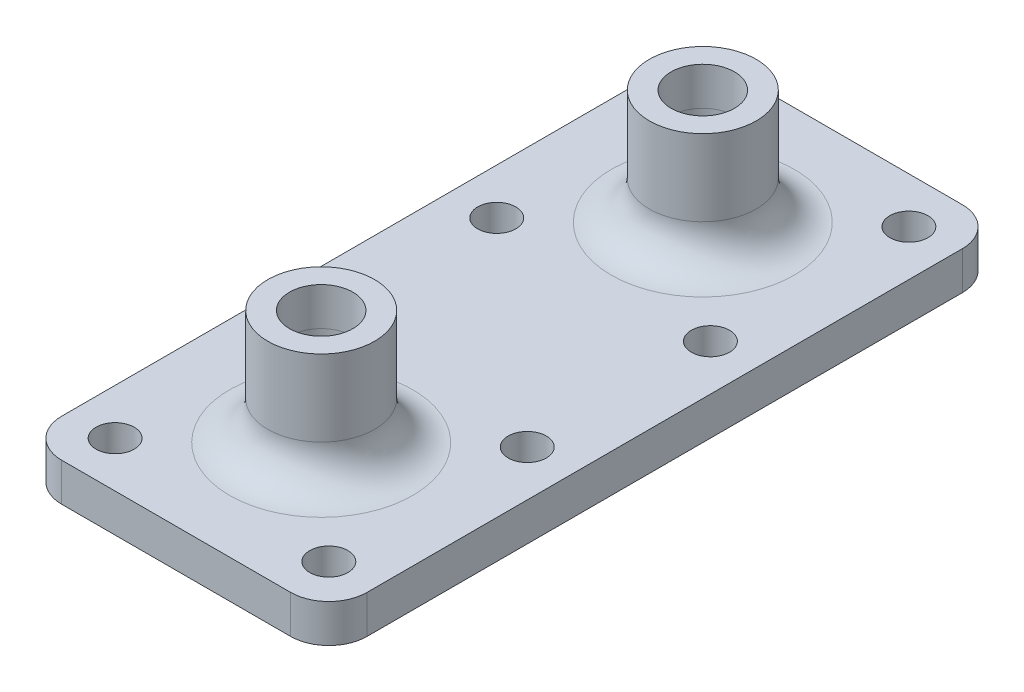
ISO-10303-21;
HEADER;
FILE_DESCRIPTION(('STEP AP214'),'2;1');
FILE_NAME('part.step','',(''),(''),'','','');
FILE_SCHEMA(('AUTOMOTIVE_DESIGN { 1 0 10303 214 1 1 1 1 }'));
ENDSEC;
DATA;
#1=APPLICATION_CONTEXT('core data for automotive mechanical design processes');
#2=APPLICATION_PROTOCOL_DEFINITION('international standard','automotive_design',2000,#1);
#3=PRODUCT_CONTEXT('',#1,'mechanical');
#4=PRODUCT('Part','Part','',(#3));
#5=PRODUCT_RELATED_PRODUCT_CATEGORY('part','',(#4));
#6=PRODUCT_DEFINITION_FORMATION('','',#4);
#7=PRODUCT_DEFINITION_CONTEXT('part definition',#1,'design');
#8=PRODUCT_DEFINITION('design','',#6,#7);
#9=PRODUCT_DEFINITION_SHAPE('','',#8);
#10=(LENGTH_UNIT() NAMED_UNIT(*) SI_UNIT(.MILLI.,.METRE.));
#11=(NAMED_UNIT(*) PLANE_ANGLE_UNIT() SI_UNIT($,.RADIAN.));
#12=(NAMED_UNIT(*) SI_UNIT($,.STERADIAN.) SOLID_ANGLE_UNIT());
#13=UNCERTAINTY_MEASURE_WITH_UNIT(LENGTH_MEASURE(1.E-05),#10,'distance_accuracy_value','');
#14=(GEOMETRIC_REPRESENTATION_CONTEXT(3) GLOBAL_UNCERTAINTY_ASSIGNED_CONTEXT((#13)) GLOBAL_UNIT_ASSIGNED_CONTEXT((#10,
#11,#12)) REPRESENTATION_CONTEXT('',''));
#15=CARTESIAN_POINT('',(0.,0.,0.));
#16=DIRECTION('',(0.,0.,1.));
#17=DIRECTION('',(1.,0.,0.));
#18=AXIS2_PLACEMENT_3D('',#15,#16,#17);
#19=CARTESIAN_POINT('',(0.,5.,0.));
#20=DIRECTION('',(0.,1.,0.));
#21=DIRECTION('',(0.,0.,1.));
#22=AXIS2_PLACEMENT_3D('',#19,#20,#21);
#23=PLANE('',#22);
#24=CARTESIAN_POINT('',(0.,5.,25.));
#25=DIRECTION('',(0.,1.,0.));
#26=DIRECTION('',(0.,0.,1.));
#27=AXIS2_PLACEMENT_3D('',#24,#25,#26);
#28=CIRCLE('',#27,12.);
#29=CARTESIAN_POINT('',(0.,5.,37.));
#30=VERTEX_POINT('',#29);
#31=EDGE_CURVE('E167',#30,#30,#28,.F.);
#32=ORIENTED_EDGE('',*,*,#31,.T.);
#33=EDGE_LOOP('',(#32));
#34=FACE_BOUND('',#33,.T.);
#35=CARTESIAN_POINT('',(0.,5.,-25.));
#36=DIRECTION('',(0.,1.,0.));
#37=DIRECTION('',(0.,0.,1.));
#38=AXIS2_PLACEMENT_3D('',#35,#36,#37);
#39=CIRCLE('',#38,12.);
#40=CARTESIAN_POINT('',(0.,5.,-13.));
#41=VERTEX_POINT('',#40);
#42=EDGE_CURVE('E164',#41,#41,#39,.F.);
#43=ORIENTED_EDGE('',*,*,#42,.T.);
#44=EDGE_LOOP('',(#43));
#45=FACE_BOUND('',#44,.T.);
#46=CARTESIAN_POINT('',(14.,5.,37.9999999999999));
#47=DIRECTION('',(0.,1.,0.));
#48=DIRECTION('',(0.,0.,1.));
#49=AXIS2_PLACEMENT_3D('',#46,#47,#48);
#50=CIRCLE('',#49,2.5);
#51=CARTESIAN_POINT('',(14.,5.,40.4999999999999));
#52=VERTEX_POINT('',#51);
#53=EDGE_CURVE('E207',#52,#52,#50,.T.);
#54=ORIENTED_EDGE('',*,*,#53,.F.);
#55=EDGE_LOOP('',(#54));
#56=FACE_BOUND('',#55,.T.);
#57=CARTESIAN_POINT('',(-14.,5.,11.9999999999999));
#58=DIRECTION('',(0.,1.,0.));
#59=DIRECTION('',(0.,0.,1.));
#60=AXIS2_PLACEMENT_3D('',#57,#58,#59);
#61=CIRCLE('',#60,2.5);
#62=CARTESIAN_POINT('',(-14.,5.,14.4999999999999));
#63=VERTEX_POINT('',#62);
#64=EDGE_CURVE('E211',#63,#63,#61,.T.);
#65=ORIENTED_EDGE('',*,*,#64,.F.);
#66=EDGE_LOOP('',(#65));
#67=FACE_BOUND('',#66,.T.);
#68=CARTESIAN_POINT('',(14.,5.,-12.0000000000001));
#69=DIRECTION('',(0.,1.,0.));
#70=DIRECTION('',(0.,0.,1.));
#71=AXIS2_PLACEMENT_3D('',#68,#69,#70);
#72=CIRCLE('',#71,2.5);
#73=CARTESIAN_POINT('',(14.,5.,-9.50000000000014));
#74=VERTEX_POINT('',#73);
#75=EDGE_CURVE('E215',#74,#74,#72,.T.);
#76=ORIENTED_EDGE('',*,*,#75,.F.);
#77=EDGE_LOOP('',(#76));
#78=FACE_BOUND('',#77,.T.);
#79=CARTESIAN_POINT('',(14.,5.,-38.0000000000001));
#80=DIRECTION('',(0.,1.,0.));
#81=DIRECTION('',(0.,0.,1.));
#82=AXIS2_PLACEMENT_3D('',#79,#80,#81);
#83=CIRCLE('',#82,2.5);
#84=CARTESIAN_POINT('',(14.,5.,-35.5000000000001));
#85=VERTEX_POINT('',#84);
#86=EDGE_CURVE('E218',#85,#85,#83,.T.);
#87=ORIENTED_EDGE('',*,*,#86,.F.);
#88=EDGE_LOOP('',(#87));
#89=FACE_BOUND('',#88,.T.);
#90=DIRECTION('',(0.,0.,-1.));
#91=VECTOR('',#90,1.);
#92=CARTESIAN_POINT('',(20.,5.,44.0000000000001));
#93=LINE('',#92,#91);
#94=CARTESIAN_POINT('',(20.,5.,39.0000000000001));
#95=VERTEX_POINT('',#94);
#96=CARTESIAN_POINT('',(20.,5.,-39.0000000000001));
#97=VERTEX_POINT('',#96);
#98=EDGE_CURVE('E222',#95,#97,#93,.T.);
#99=ORIENTED_EDGE('',*,*,#98,.T.);
#100=CARTESIAN_POINT('',(15.,5.,-39.0000000000001));
#101=DIRECTION('',(0.,1.,0.));
#102=DIRECTION('',(0.,0.,1.));
#103=AXIS2_PLACEMENT_3D('',#100,#101,#102);
#104=CIRCLE('',#103,5.);
#105=CARTESIAN_POINT('',(15.,5.,-44.0000000000001));
#106=VERTEX_POINT('',#105);
#107=EDGE_CURVE('E175',#97,#106,#104,.T.);
#108=ORIENTED_EDGE('',*,*,#107,.T.);
#109=DIRECTION('',(-1.,0.,0.));
#110=VECTOR('',#109,1.);
#111=CARTESIAN_POINT('',(20.,5.,-44.0000000000001));
#112=LINE('',#111,#110);
#113=CARTESIAN_POINT('',(-15.,5.,-44.0000000000001));
#114=VERTEX_POINT('',#113);
#115=EDGE_CURVE('E128',#106,#114,#112,.T.);
#116=ORIENTED_EDGE('',*,*,#115,.T.);
#117=CARTESIAN_POINT('',(-15.,5.,-39.0000000000001));
#118=DIRECTION('',(0.,1.,0.));
#119=DIRECTION('',(0.,0.,1.));
#120=AXIS2_PLACEMENT_3D('',#117,#118,#119);
#121=CIRCLE('',#120,5.);
#122=CARTESIAN_POINT('',(-20.,5.,-39.0000000000001));
#123=VERTEX_POINT('',#122);
#124=EDGE_CURVE('E173',#114,#123,#121,.T.);
#125=ORIENTED_EDGE('',*,*,#124,.T.);
#126=DIRECTION('',(0.,0.,1.));
#127=VECTOR('',#126,1.);
#128=CARTESIAN_POINT('',(-20.,5.,44.0000000000001));
#129=LINE('',#128,#127);
#130=CARTESIAN_POINT('',(-20.,5.,39.0000000000001));
#131=VERTEX_POINT('',#130);
#132=EDGE_CURVE('E135',#123,#131,#129,.T.);
#133=ORIENTED_EDGE('',*,*,#132,.T.);
#134=CARTESIAN_POINT('',(-15.,5.,39.0000000000001));
#135=DIRECTION('',(0.,1.,0.));
#136=DIRECTION('',(0.,0.,1.));
#137=AXIS2_PLACEMENT_3D('',#134,#135,#136);
#138=CIRCLE('',#137,5.);
#139=CARTESIAN_POINT('',(-15.,5.,44.0000000000001));
#140=VERTEX_POINT('',#139);
#141=EDGE_CURVE('E63',#131,#140,#138,.T.);
#142=ORIENTED_EDGE('',*,*,#141,.T.);
#143=DIRECTION('',(1.,0.,0.));
#144=VECTOR('',#143,1.);
#145=CARTESIAN_POINT('',(20.,5.,44.0000000000001));
#146=LINE('',#145,#144);
#147=CARTESIAN_POINT('',(15.,5.,44.0000000000001));
#148=VERTEX_POINT('',#147);
#149=EDGE_CURVE('E138',#140,#148,#146,.T.);
#150=ORIENTED_EDGE('',*,*,#149,.T.);
#151=CARTESIAN_POINT('',(15.,5.,39.0000000000001));
#152=DIRECTION('',(0.,1.,0.));
#153=DIRECTION('',(0.,0.,1.));
#154=AXIS2_PLACEMENT_3D('',#151,#152,#153);
#155=CIRCLE('',#154,5.);
#156=EDGE_CURVE('E170',#148,#95,#155,.T.);
#157=ORIENTED_EDGE('',*,*,#156,.T.);
#158=EDGE_LOOP('',(#99,#108,#116,#125,#133,#142,#150,#157));
#159=FACE_BOUND('',#158,.T.);
#160=CARTESIAN_POINT('',(-14.,5.,-12.0000000000001));
#161=DIRECTION('',(0.,1.,0.));
#162=DIRECTION('',(0.,0.,1.));
#163=AXIS2_PLACEMENT_3D('',#160,#161,#162);
#164=CIRCLE('',#163,2.5);
#165=CARTESIAN_POINT('',(-14.,5.,-9.50000000000013));
#166=VERTEX_POINT('',#165);
#167=EDGE_CURVE('E226',#166,#166,#164,.T.);
#168=ORIENTED_EDGE('',*,*,#167,.F.);
#169=EDGE_LOOP('',(#168));
#170=FACE_BOUND('',#169,.T.);
#171=CARTESIAN_POINT('',(-14.,5.,-38.0000000000001));
#172=DIRECTION('',(0.,1.,0.));
#173=DIRECTION('',(0.,0.,1.));
#174=AXIS2_PLACEMENT_3D('',#171,#172,#173);
#175=CIRCLE('',#174,2.5);
#176=CARTESIAN_POINT('',(-14.,5.,-35.5000000000001));
#177=VERTEX_POINT('',#176);
#178=EDGE_CURVE('E230',#177,#177,#175,.T.);
#179=ORIENTED_EDGE('',*,*,#178,.F.);
#180=EDGE_LOOP('',(#179));
#181=FACE_BOUND('',#180,.T.);
#182=CARTESIAN_POINT('',(-14.,5.,37.9999999999999));
#183=DIRECTION('',(0.,1.,0.));
#184=DIRECTION('',(0.,0.,1.));
#185=AXIS2_PLACEMENT_3D('',#182,#183,#184);
#186=CIRCLE('',#185,2.5);
#187=CARTESIAN_POINT('',(-14.,5.,40.4999999999999));
#188=VERTEX_POINT('',#187);
#189=EDGE_CURVE('E234',#188,#188,#186,.T.);
#190=ORIENTED_EDGE('',*,*,#189,.F.);
#191=EDGE_LOOP('',(#190));
#192=FACE_BOUND('',#191,.T.);
#193=CARTESIAN_POINT('',(14.,5.,11.9999999999999));
#194=DIRECTION('',(0.,1.,0.));
#195=DIRECTION('',(0.,0.,1.));
#196=AXIS2_PLACEMENT_3D('',#193,#194,#195);
#197=CIRCLE('',#196,2.5);
#198=CARTESIAN_POINT('',(14.,5.,14.4999999999999));
#199=VERTEX_POINT('',#198);
#200=EDGE_CURVE('E237',#199,#199,#197,.T.);
#201=ORIENTED_EDGE('',*,*,#200,.F.);
#202=EDGE_LOOP('',(#201));
#203=FACE_BOUND('',#202,.T.);
#204=ADVANCED_FACE('F41',(#34,#45,#56,#67,#78,#89,#159,#170,#181,#192,#203),#23,.T.);
#205=CARTESIAN_POINT('',(0.,0.,0.));
#206=DIRECTION('',(0.,1.,0.));
#207=DIRECTION('',(0.,0.,1.));
#208=AXIS2_PLACEMENT_3D('',#205,#206,#207);
#209=PLANE('',#208);
#210=DIRECTION('',(-1.,0.,0.));
#211=VECTOR('',#210,1.);
#212=CARTESIAN_POINT('',(20.,0.,-44.0000000000001));
#213=LINE('',#212,#211);
#214=CARTESIAN_POINT('',(15.,0.,-44.0000000000001));
#215=VERTEX_POINT('',#214);
#216=CARTESIAN_POINT('',(-15.,0.,-44.0000000000001));
#217=VERTEX_POINT('',#216);
#218=EDGE_CURVE('E125',#215,#217,#213,.T.);
#219=ORIENTED_EDGE('',*,*,#218,.F.);
#220=CARTESIAN_POINT('',(15.,0.,-39.0000000000001));
#221=DIRECTION('',(0.,1.,0.));
#222=DIRECTION('',(0.,0.,1.));
#223=AXIS2_PLACEMENT_3D('',#220,#221,#222);
#224=CIRCLE('',#223,5.);
#225=CARTESIAN_POINT('',(20.,0.,-39.0000000000001));
#226=VERTEX_POINT('',#225);
#227=EDGE_CURVE('E108',#215,#226,#224,.F.);
#228=ORIENTED_EDGE('',*,*,#227,.T.);
#229=DIRECTION('',(0.,0.,-1.));
#230=VECTOR('',#229,1.);
#231=CARTESIAN_POINT('',(20.,0.,44.0000000000001));
#232=LINE('',#231,#230);
#233=CARTESIAN_POINT('',(20.,0.,39.0000000000001));
#234=VERTEX_POINT('',#233);
#235=EDGE_CURVE('E136',#234,#226,#232,.T.);
#236=ORIENTED_EDGE('',*,*,#235,.F.);
#237=CARTESIAN_POINT('',(15.,0.,39.0000000000001));
#238=DIRECTION('',(0.,1.,0.));
#239=DIRECTION('',(0.,0.,1.));
#240=AXIS2_PLACEMENT_3D('',#237,#238,#239);
#241=CIRCLE('',#240,5.);
#242=CARTESIAN_POINT('',(15.,0.,44.0000000000001));
#243=VERTEX_POINT('',#242);
#244=EDGE_CURVE('E129',#234,#243,#241,.F.);
#245=ORIENTED_EDGE('',*,*,#244,.T.);
#246=DIRECTION('',(1.,0.,0.));
#247=VECTOR('',#246,1.);
#248=CARTESIAN_POINT('',(20.,0.,44.0000000000001));
#249=LINE('',#248,#247);
#250=CARTESIAN_POINT('',(-15.,0.,44.0000000000001));
#251=VERTEX_POINT('',#250);
#252=EDGE_CURVE('E140',#251,#243,#249,.T.);
#253=ORIENTED_EDGE('',*,*,#252,.F.);
#254=CARTESIAN_POINT('',(-15.,0.,39.0000000000001));
#255=DIRECTION('',(0.,1.,0.));
#256=DIRECTION('',(0.,0.,1.));
#257=AXIS2_PLACEMENT_3D('',#254,#255,#256);
#258=CIRCLE('',#257,5.);
#259=CARTESIAN_POINT('',(-20.,0.,39.0000000000001));
#260=VERTEX_POINT('',#259);
#261=EDGE_CURVE('E158',#251,#260,#258,.F.);
#262=ORIENTED_EDGE('',*,*,#261,.T.);
#263=DIRECTION('',(0.,0.,1.));
#264=VECTOR('',#263,1.);
#265=CARTESIAN_POINT('',(-20.,0.,44.0000000000001));
#266=LINE('',#265,#264);
#267=CARTESIAN_POINT('',(-20.,0.,-39.0000000000001));
#268=VERTEX_POINT('',#267);
#269=EDGE_CURVE('E273',#268,#260,#266,.T.);
#270=ORIENTED_EDGE('',*,*,#269,.F.);
#271=CARTESIAN_POINT('',(-15.,0.,-39.0000000000001));
#272=DIRECTION('',(0.,1.,0.));
#273=DIRECTION('',(0.,0.,1.));
#274=AXIS2_PLACEMENT_3D('',#271,#272,#273);
#275=CIRCLE('',#274,5.);
#276=EDGE_CURVE('E119',#268,#217,#275,.F.);
#277=ORIENTED_EDGE('',*,*,#276,.T.);
#278=EDGE_LOOP('',(#219,#228,#236,#245,#253,#262,#270,#277));
#279=FACE_BOUND('',#278,.T.);
#280=CARTESIAN_POINT('',(14.,0.,-38.0000000000001));
#281=DIRECTION('',(0.,1.,0.));
#282=DIRECTION('',(0.,0.,1.));
#283=AXIS2_PLACEMENT_3D('',#280,#281,#282);
#284=CIRCLE('',#283,2.5);
#285=CARTESIAN_POINT('',(14.,0.,-35.5000000000001));
#286=VERTEX_POINT('',#285);
#287=EDGE_CURVE('E269',#286,#286,#284,.T.);
#288=ORIENTED_EDGE('',*,*,#287,.T.);
#289=EDGE_LOOP('',(#288));
#290=FACE_BOUND('',#289,.T.);
#291=CARTESIAN_POINT('',(-14.,0.,-12.0000000000001));
#292=DIRECTION('',(0.,1.,0.));
#293=DIRECTION('',(0.,0.,1.));
#294=AXIS2_PLACEMENT_3D('',#291,#292,#293);
#295=CIRCLE('',#294,2.5);
#296=CARTESIAN_POINT('',(-14.,0.,-9.50000000000013));
#297=VERTEX_POINT('',#296);
#298=EDGE_CURVE('E265',#297,#297,#295,.T.);
#299=ORIENTED_EDGE('',*,*,#298,.T.);
#300=EDGE_LOOP('',(#299));
#301=FACE_BOUND('',#300,.T.);
#302=CARTESIAN_POINT('',(14.,0.,-12.0000000000001));
#303=DIRECTION('',(0.,1.,0.));
#304=DIRECTION('',(0.,0.,1.));
#305=AXIS2_PLACEMENT_3D('',#302,#303,#304);
#306=CIRCLE('',#305,2.5);
#307=CARTESIAN_POINT('',(14.,0.,-9.50000000000014));
#308=VERTEX_POINT('',#307);
#309=EDGE_CURVE('E261',#308,#308,#306,.T.);
#310=ORIENTED_EDGE('',*,*,#309,.T.);
#311=EDGE_LOOP('',(#310));
#312=FACE_BOUND('',#311,.T.);
#313=CARTESIAN_POINT('',(-14.,0.,-38.0000000000001));
#314=DIRECTION('',(0.,1.,0.));
#315=DIRECTION('',(0.,0.,1.));
#316=AXIS2_PLACEMENT_3D('',#313,#314,#315);
#317=CIRCLE('',#316,2.5);
#318=CARTESIAN_POINT('',(-14.,0.,-35.5000000000001));
#319=VERTEX_POINT('',#318);
#320=EDGE_CURVE('E257',#319,#319,#317,.T.);
#321=ORIENTED_EDGE('',*,*,#320,.T.);
#322=EDGE_LOOP('',(#321));
#323=FACE_BOUND('',#322,.T.);
#324=CARTESIAN_POINT('',(-14.,0.,11.9999999999999));
#325=DIRECTION('',(0.,1.,0.));
#326=DIRECTION('',(0.,0.,1.));
#327=AXIS2_PLACEMENT_3D('',#324,#325,#326);
#328=CIRCLE('',#327,2.5);
#329=CARTESIAN_POINT('',(-14.,0.,14.4999999999999));
#330=VERTEX_POINT('',#329);
#331=EDGE_CURVE('E253',#330,#330,#328,.T.);
#332=ORIENTED_EDGE('',*,*,#331,.T.);
#333=EDGE_LOOP('',(#332));
#334=FACE_BOUND('',#333,.T.);
#335=CARTESIAN_POINT('',(-14.,0.,37.9999999999999));
#336=DIRECTION('',(0.,1.,0.));
#337=DIRECTION('',(0.,0.,1.));
#338=AXIS2_PLACEMENT_3D('',#335,#336,#337);
#339=CIRCLE('',#338,2.5);
#340=CARTESIAN_POINT('',(-14.,0.,40.4999999999999));
#341=VERTEX_POINT('',#340);
#342=EDGE_CURVE('E250',#341,#341,#339,.T.);
#343=ORIENTED_EDGE('',*,*,#342,.T.);
#344=EDGE_LOOP('',(#343));
#345=FACE_BOUND('',#344,.T.);
#346=CARTESIAN_POINT('',(14.,0.,37.9999999999999));
#347=DIRECTION('',(0.,1.,0.));
#348=DIRECTION('',(0.,0.,1.));
#349=AXIS2_PLACEMENT_3D('',#346,#347,#348);
#350=CIRCLE('',#349,2.5);
#351=CARTESIAN_POINT('',(14.,0.,40.4999999999999));
#352=VERTEX_POINT('',#351);
#353=EDGE_CURVE('E239',#352,#352,#350,.T.);
#354=ORIENTED_EDGE('',*,*,#353,.T.);
#355=EDGE_LOOP('',(#354));
#356=FACE_BOUND('',#355,.T.);
#357=CARTESIAN_POINT('',(14.,0.,11.9999999999999));
#358=DIRECTION('',(0.,1.,0.));
#359=DIRECTION('',(0.,0.,1.));
#360=AXIS2_PLACEMENT_3D('',#357,#358,#359);
#361=CIRCLE('',#360,2.5);
#362=CARTESIAN_POINT('',(14.,0.,14.4999999999999));
#363=VERTEX_POINT('',#362);
#364=EDGE_CURVE('E240',#363,#363,#361,.T.);
#365=ORIENTED_EDGE('',*,*,#364,.T.);
#366=EDGE_LOOP('',(#365));
#367=FACE_BOUND('',#366,.T.);
#368=ADVANCED_FACE('F132',(#279,#290,#301,#312,#323,#334,#345,#356,#367),#209,.F.);
#369=CARTESIAN_POINT('',(-20.,5.,44.0000000000001));
#370=DIRECTION('',(1.,0.,0.));
#371=DIRECTION('',(0.,0.,-1.));
#372=AXIS2_PLACEMENT_3D('',#369,#370,#371);
#373=PLANE('',#372);
#374=ORIENTED_EDGE('',*,*,#132,.F.);
#375=DIRECTION('',(0.,-1.,0.));
#376=VECTOR('',#375,1.);
#377=CARTESIAN_POINT('',(-20.,5.,-39.0000000000001));
#378=LINE('',#377,#376);
#379=EDGE_CURVE('E179',#123,#268,#378,.T.);
#380=ORIENTED_EDGE('',*,*,#379,.T.);
#381=ORIENTED_EDGE('',*,*,#269,.T.);
#382=DIRECTION('',(0.,-1.,0.));
#383=VECTOR('',#382,1.);
#384=CARTESIAN_POINT('',(-20.,5.,39.0000000000001));
#385=LINE('',#384,#383);
#386=EDGE_CURVE('E177',#260,#131,#385,.F.);
#387=ORIENTED_EDGE('',*,*,#386,.T.);
#388=EDGE_LOOP('',(#374,#380,#381,#387));
#389=FACE_BOUND('',#388,.T.);
#390=ADVANCED_FACE('F296',(#389),#373,.F.);
#391=CARTESIAN_POINT('',(20.,5.,44.0000000000001));
#392=DIRECTION('',(0.,0.,-1.));
#393=DIRECTION('',(-1.,0.,0.));
#394=AXIS2_PLACEMENT_3D('',#391,#392,#393);
#395=PLANE('',#394);
#396=ORIENTED_EDGE('',*,*,#149,.F.);
#397=DIRECTION('',(0.,-1.,0.));
#398=VECTOR('',#397,1.);
#399=CARTESIAN_POINT('',(-15.,5.,44.0000000000001));
#400=LINE('',#399,#398);
#401=EDGE_CURVE('E183',#140,#251,#400,.T.);
#402=ORIENTED_EDGE('',*,*,#401,.T.);
#403=ORIENTED_EDGE('',*,*,#252,.T.);
#404=DIRECTION('',(0.,-1.,0.));
#405=VECTOR('',#404,1.);
#406=CARTESIAN_POINT('',(15.,5.,44.0000000000001));
#407=LINE('',#406,#405);
#408=EDGE_CURVE('E56',#243,#148,#407,.F.);
#409=ORIENTED_EDGE('',*,*,#408,.T.);
#410=EDGE_LOOP('',(#396,#402,#403,#409));
#411=FACE_BOUND('',#410,.T.);
#412=ADVANCED_FACE('F281',(#411),#395,.F.);
#413=CARTESIAN_POINT('',(20.,5.,44.0000000000001));
#414=DIRECTION('',(-1.,0.,0.));
#415=DIRECTION('',(0.,0.,1.));
#416=AXIS2_PLACEMENT_3D('',#413,#414,#415);
#417=PLANE('',#416);
#418=ORIENTED_EDGE('',*,*,#235,.T.);
#419=DIRECTION('',(0.,-1.,0.));
#420=VECTOR('',#419,1.);
#421=CARTESIAN_POINT('',(20.,5.,-39.0000000000001));
#422=LINE('',#421,#420);
#423=EDGE_CURVE('E113',#226,#97,#422,.F.);
#424=ORIENTED_EDGE('',*,*,#423,.T.);
#425=ORIENTED_EDGE('',*,*,#98,.F.);
#426=DIRECTION('',(0.,-1.,0.));
#427=VECTOR('',#426,1.);
#428=CARTESIAN_POINT('',(20.,5.,39.0000000000001));
#429=LINE('',#428,#427);
#430=EDGE_CURVE('E118',#95,#234,#429,.T.);
#431=ORIENTED_EDGE('',*,*,#430,.T.);
#432=EDGE_LOOP('',(#418,#424,#425,#431));
#433=FACE_BOUND('',#432,.T.);
#434=ADVANCED_FACE('F287',(#433),#417,.F.);
#435=CARTESIAN_POINT('',(20.,5.,-44.0000000000001));
#436=DIRECTION('',(0.,0.,1.));
#437=DIRECTION('',(1.,0.,0.));
#438=AXIS2_PLACEMENT_3D('',#435,#436,#437);
#439=PLANE('',#438);
#440=ORIENTED_EDGE('',*,*,#115,.F.);
#441=DIRECTION('',(0.,-1.,0.));
#442=VECTOR('',#441,1.);
#443=CARTESIAN_POINT('',(15.,5.,-44.0000000000001));
#444=LINE('',#443,#442);
#445=EDGE_CURVE('E112',#106,#215,#444,.T.);
#446=ORIENTED_EDGE('',*,*,#445,.T.);
#447=ORIENTED_EDGE('',*,*,#218,.T.);
#448=DIRECTION('',(0.,-1.,0.));
#449=VECTOR('',#448,1.);
#450=CARTESIAN_POINT('',(-15.,5.,-44.0000000000001));
#451=LINE('',#450,#449);
#452=EDGE_CURVE('E130',#217,#114,#451,.F.);
#453=ORIENTED_EDGE('',*,*,#452,.T.);
#454=EDGE_LOOP('',(#440,#446,#447,#453));
#455=FACE_BOUND('',#454,.T.);
#456=ADVANCED_FACE('F124',(#455),#439,.F.);
#457=CARTESIAN_POINT('',(14.,5.,-38.0000000000001));
#458=DIRECTION('',(0.,-1.,0.));
#459=DIRECTION('',(0.,0.,-1.));
#460=AXIS2_PLACEMENT_3D('',#457,#458,#459);
#461=CYLINDRICAL_SURFACE('',#460,2.5);
#462=ORIENTED_EDGE('',*,*,#86,.T.);
#463=EDGE_LOOP('',(#462));
#464=FACE_BOUND('',#463,.T.);
#465=ORIENTED_EDGE('',*,*,#287,.F.);
#466=EDGE_LOOP('',(#465));
#467=FACE_BOUND('',#466,.T.);
#468=ADVANCED_FACE('F294',(#464,#467),#461,.F.);
#469=CARTESIAN_POINT('',(-14.,5.,-12.0000000000001));
#470=DIRECTION('',(0.,-1.,0.));
#471=DIRECTION('',(0.,0.,-1.));
#472=AXIS2_PLACEMENT_3D('',#469,#470,#471);
#473=CYLINDRICAL_SURFACE('',#472,2.5);
#474=ORIENTED_EDGE('',*,*,#167,.T.);
#475=EDGE_LOOP('',(#474));
#476=FACE_BOUND('',#475,.T.);
#477=ORIENTED_EDGE('',*,*,#298,.F.);
#478=EDGE_LOOP('',(#477));
#479=FACE_BOUND('',#478,.T.);
#480=ADVANCED_FACE('F602',(#476,#479),#473,.F.);
#481=CARTESIAN_POINT('',(14.,5.,-12.0000000000001));
#482=DIRECTION('',(0.,-1.,0.));
#483=DIRECTION('',(0.,0.,-1.));
#484=AXIS2_PLACEMENT_3D('',#481,#482,#483);
#485=CYLINDRICAL_SURFACE('',#484,2.5);
#486=ORIENTED_EDGE('',*,*,#75,.T.);
#487=EDGE_LOOP('',(#486));
#488=FACE_BOUND('',#487,.T.);
#489=ORIENTED_EDGE('',*,*,#309,.F.);
#490=EDGE_LOOP('',(#489));
#491=FACE_BOUND('',#490,.T.);
#492=ADVANCED_FACE('F590',(#488,#491),#485,.F.);
#493=CARTESIAN_POINT('',(-14.,5.,-38.0000000000001));
#494=DIRECTION('',(0.,-1.,0.));
#495=DIRECTION('',(0.,0.,-1.));
#496=AXIS2_PLACEMENT_3D('',#493,#494,#495);
#497=CYLINDRICAL_SURFACE('',#496,2.5);
#498=ORIENTED_EDGE('',*,*,#178,.T.);
#499=EDGE_LOOP('',(#498));
#500=FACE_BOUND('',#499,.T.);
#501=ORIENTED_EDGE('',*,*,#320,.F.);
#502=EDGE_LOOP('',(#501));
#503=FACE_BOUND('',#502,.T.);
#504=ADVANCED_FACE('F578',(#500,#503),#497,.F.);
#505=CARTESIAN_POINT('',(-14.,5.,11.9999999999999));
#506=DIRECTION('',(0.,-1.,0.));
#507=DIRECTION('',(0.,0.,-1.));
#508=AXIS2_PLACEMENT_3D('',#505,#506,#507);
#509=CYLINDRICAL_SURFACE('',#508,2.5);
#510=ORIENTED_EDGE('',*,*,#64,.T.);
#511=EDGE_LOOP('',(#510));
#512=FACE_BOUND('',#511,.T.);
#513=ORIENTED_EDGE('',*,*,#331,.F.);
#514=EDGE_LOOP('',(#513));
#515=FACE_BOUND('',#514,.T.);
#516=ADVANCED_FACE('F566',(#512,#515),#509,.F.);
#517=CARTESIAN_POINT('',(-14.,5.,37.9999999999999));
#518=DIRECTION('',(0.,-1.,0.));
#519=DIRECTION('',(0.,0.,-1.));
#520=AXIS2_PLACEMENT_3D('',#517,#518,#519);
#521=CYLINDRICAL_SURFACE('',#520,2.5);
#522=ORIENTED_EDGE('',*,*,#189,.T.);
#523=EDGE_LOOP('',(#522));
#524=FACE_BOUND('',#523,.T.);
#525=ORIENTED_EDGE('',*,*,#342,.F.);
#526=EDGE_LOOP('',(#525));
#527=FACE_BOUND('',#526,.T.);
#528=ADVANCED_FACE('F554',(#524,#527),#521,.F.);
#529=CARTESIAN_POINT('',(14.,5.,37.9999999999999));
#530=DIRECTION('',(0.,-1.,0.));
#531=DIRECTION('',(0.,0.,-1.));
#532=AXIS2_PLACEMENT_3D('',#529,#530,#531);
#533=CYLINDRICAL_SURFACE('',#532,2.5);
#534=ORIENTED_EDGE('',*,*,#53,.T.);
#535=EDGE_LOOP('',(#534));
#536=FACE_BOUND('',#535,.T.);
#537=ORIENTED_EDGE('',*,*,#353,.F.);
#538=EDGE_LOOP('',(#537));
#539=FACE_BOUND('',#538,.T.);
#540=ADVANCED_FACE('F544',(#536,#539),#533,.F.);
#541=CARTESIAN_POINT('',(14.,5.,11.9999999999999));
#542=DIRECTION('',(0.,-1.,0.));
#543=DIRECTION('',(0.,0.,-1.));
#544=AXIS2_PLACEMENT_3D('',#541,#542,#543);
#545=CYLINDRICAL_SURFACE('',#544,2.5);
#546=ORIENTED_EDGE('',*,*,#200,.T.);
#547=EDGE_LOOP('',(#546));
#548=FACE_BOUND('',#547,.T.);
#549=ORIENTED_EDGE('',*,*,#364,.F.);
#550=EDGE_LOOP('',(#549));
#551=FACE_BOUND('',#550,.T.);
#552=ADVANCED_FACE('F533',(#548,#551),#545,.F.);
#553=CARTESIAN_POINT('',(0.,20.,25.));
#554=DIRECTION('',(0.,1.,0.));
#555=DIRECTION('',(0.,0.,1.));
#556=AXIS2_PLACEMENT_3D('',#553,#554,#555);
#557=PLANE('',#556);
#558=CARTESIAN_POINT('',(0.,20.,25.));
#559=DIRECTION('',(0.,1.,0.));
#560=DIRECTION('',(0.,0.,1.));
#561=AXIS2_PLACEMENT_3D('',#558,#559,#560);
#562=CIRCLE('',#561,6.99999999999999);
#563=CARTESIAN_POINT('',(0.,20.,32.));
#564=VERTEX_POINT('',#563);
#565=EDGE_CURVE('E245',#564,#564,#562,.T.);
#566=ORIENTED_EDGE('',*,*,#565,.T.);
#567=EDGE_LOOP('',(#566));
#568=FACE_BOUND('',#567,.T.);
#569=CARTESIAN_POINT('',(0.,20.,25.));
#570=DIRECTION('',(0.,1.,0.));
#571=DIRECTION('',(0.,0.,1.));
#572=AXIS2_PLACEMENT_3D('',#569,#570,#571);
#573=CIRCLE('',#572,4.15);
#574=CARTESIAN_POINT('',(0.,20.,29.15));
#575=VERTEX_POINT('',#574);
#576=EDGE_CURVE('E709',#575,#575,#573,.T.);
#577=ORIENTED_EDGE('',*,*,#576,.F.);
#578=EDGE_LOOP('',(#577));
#579=FACE_BOUND('',#578,.T.);
#580=ADVANCED_FACE('F409',(#568,#579),#557,.T.);
#581=CARTESIAN_POINT('',(0.,20.,25.));
#582=DIRECTION('',(0.,-1.,0.));
#583=DIRECTION('',(0.,0.,-1.));
#584=AXIS2_PLACEMENT_3D('',#581,#582,#583);
#585=CYLINDRICAL_SURFACE('',#584,6.99999999999999);
#586=CARTESIAN_POINT('',(0.,10.,25.));
#587=DIRECTION('',(0.,1.,0.));
#588=DIRECTION('',(0.,0.,1.));
#589=AXIS2_PLACEMENT_3D('',#586,#587,#588);
#590=CIRCLE('',#589,6.99999999999999);
#591=CARTESIAN_POINT('',(0.,10.,32.));
#592=VERTEX_POINT('',#591);
#593=EDGE_CURVE('E49',#592,#592,#590,.T.);
#594=ORIENTED_EDGE('',*,*,#593,.T.);
#595=EDGE_LOOP('',(#594));
#596=FACE_BOUND('',#595,.T.);
#597=ORIENTED_EDGE('',*,*,#565,.F.);
#598=EDGE_LOOP('',(#597));
#599=FACE_BOUND('',#598,.T.);
#600=ADVANCED_FACE('F188',(#596,#599),#585,.T.);
#601=CARTESIAN_POINT('',(0.,20.,25.));
#602=DIRECTION('',(0.,-1.,0.));
#603=DIRECTION('',(0.,0.,-1.));
#604=AXIS2_PLACEMENT_3D('',#601,#602,#603);
#605=CYLINDRICAL_SURFACE('',#604,4.15);
#606=CARTESIAN_POINT('',(0.,14.9999999999879,25.));
#607=DIRECTION('',(0.,1.,0.));
#608=DIRECTION('',(0.,0.,1.));
#609=AXIS2_PLACEMENT_3D('',#606,#607,#608);
#610=CIRCLE('',#609,4.15);
#611=CARTESIAN_POINT('',(0.,14.9999999999879,29.15));
#612=VERTEX_POINT('',#611);
#613=EDGE_CURVE('E150',#612,#612,#610,.F.);
#614=ORIENTED_EDGE('',*,*,#613,.T.);
#615=EDGE_LOOP('',(#614));
#616=FACE_BOUND('',#615,.T.);
#617=ORIENTED_EDGE('',*,*,#576,.T.);
#618=EDGE_LOOP('',(#617));
#619=FACE_BOUND('',#618,.T.);
#620=ADVANCED_FACE('F408',(#616,#619),#605,.F.);
#621=CARTESIAN_POINT('',(0.,5.,25.));
#622=DIRECTION('',(0.,1.,0.));
#623=DIRECTION('',(0.,0.,1.));
#624=AXIS2_PLACEMENT_3D('',#621,#622,#623);
#625=CIRCLE('',#624,3.975449350718);
#626=CARTESIAN_POINT('',(0.,5.,28.975449350718));
#627=VERTEX_POINT('',#626);
#628=EDGE_CURVE('E153',#627,#627,#625,.T.);
#629=ORIENTED_EDGE('',*,*,#628,.T.);
#630=EDGE_LOOP('',(#629));
#631=FACE_BOUND('',#630,.T.);
#632=ADVANCED_FACE('F201',(#631),#23,.T.);
#633=CARTESIAN_POINT('',(0.,20.,-25.));
#634=DIRECTION('',(0.,1.,0.));
#635=DIRECTION('',(0.,0.,1.));
#636=AXIS2_PLACEMENT_3D('',#633,#634,#635);
#637=PLANE('',#636);
#638=CARTESIAN_POINT('',(0.,20.,-25.));
#639=DIRECTION('',(0.,1.,0.));
#640=DIRECTION('',(0.,0.,1.));
#641=AXIS2_PLACEMENT_3D('',#638,#639,#640);
#642=CIRCLE('',#641,6.99999999999999);
#643=CARTESIAN_POINT('',(0.,20.,-18.));
#644=VERTEX_POINT('',#643);
#645=EDGE_CURVE('E713',#644,#644,#642,.T.);
#646=ORIENTED_EDGE('',*,*,#645,.T.);
#647=EDGE_LOOP('',(#646));
#648=FACE_BOUND('',#647,.T.);
#649=CARTESIAN_POINT('',(0.,20.,-25.));
#650=DIRECTION('',(0.,1.,0.));
#651=DIRECTION('',(0.,0.,1.));
#652=AXIS2_PLACEMENT_3D('',#649,#650,#651);
#653=CIRCLE('',#652,4.15);
#654=CARTESIAN_POINT('',(0.,20.,-20.85));
#655=VERTEX_POINT('',#654);
#656=EDGE_CURVE('E711',#655,#655,#653,.T.);
#657=ORIENTED_EDGE('',*,*,#656,.F.);
#658=EDGE_LOOP('',(#657));
#659=FACE_BOUND('',#658,.T.);
#660=ADVANCED_FACE('F392',(#648,#659),#637,.T.);
#661=CARTESIAN_POINT('',(0.,20.,-25.));
#662=DIRECTION('',(0.,-1.,0.));
#663=DIRECTION('',(0.,0.,-1.));
#664=AXIS2_PLACEMENT_3D('',#661,#662,#663);
#665=CYLINDRICAL_SURFACE('',#664,6.99999999999999);
#666=CARTESIAN_POINT('',(0.,10.,-25.));
#667=DIRECTION('',(0.,1.,0.));
#668=DIRECTION('',(0.,0.,1.));
#669=AXIS2_PLACEMENT_3D('',#666,#667,#668);
#670=CIRCLE('',#669,6.99999999999999);
#671=CARTESIAN_POINT('',(0.,10.,-18.));
#672=VERTEX_POINT('',#671);
#673=EDGE_CURVE('E11',#672,#672,#670,.T.);
#674=ORIENTED_EDGE('',*,*,#673,.T.);
#675=EDGE_LOOP('',(#674));
#676=FACE_BOUND('',#675,.T.);
#677=ORIENTED_EDGE('',*,*,#645,.F.);
#678=EDGE_LOOP('',(#677));
#679=FACE_BOUND('',#678,.T.);
#680=ADVANCED_FACE('F385',(#676,#679),#665,.T.);
#681=CARTESIAN_POINT('',(0.,20.,-25.));
#682=DIRECTION('',(0.,-1.,0.));
#683=DIRECTION('',(0.,0.,-1.));
#684=AXIS2_PLACEMENT_3D('',#681,#682,#683);
#685=CYLINDRICAL_SURFACE('',#684,4.15);
#686=CARTESIAN_POINT('',(0.,14.9999999999879,-25.));
#687=DIRECTION('',(0.,1.,0.));
#688=DIRECTION('',(0.,0.,1.));
#689=AXIS2_PLACEMENT_3D('',#686,#687,#688);
#690=CIRCLE('',#689,4.15);
#691=CARTESIAN_POINT('',(0.,14.9999999999879,-20.85));
#692=VERTEX_POINT('',#691);
#693=EDGE_CURVE('E144',#692,#692,#690,.F.);
#694=ORIENTED_EDGE('',*,*,#693,.T.);
#695=EDGE_LOOP('',(#694));
#696=FACE_BOUND('',#695,.T.);
#697=ORIENTED_EDGE('',*,*,#656,.T.);
#698=EDGE_LOOP('',(#697));
#699=FACE_BOUND('',#698,.T.);
#700=ADVANCED_FACE('F391',(#696,#699),#685,.F.);
#701=CARTESIAN_POINT('',(0.,5.,-25.));
#702=DIRECTION('',(0.,1.,0.));
#703=DIRECTION('',(0.,0.,1.));
#704=AXIS2_PLACEMENT_3D('',#701,#702,#703);
#705=CIRCLE('',#704,3.975449350718);
#706=CARTESIAN_POINT('',(0.,5.,-21.024550649282));
#707=VERTEX_POINT('',#706);
#708=EDGE_CURVE('E147',#707,#707,#705,.T.);
#709=ORIENTED_EDGE('',*,*,#708,.T.);
#710=EDGE_LOOP('',(#709));
#711=FACE_BOUND('',#710,.T.);
#712=ADVANCED_FACE('F200',(#711),#23,.T.);
#713=CARTESIAN_POINT('',(0.,14.9999999999879,-25.));
#714=DIRECTION('',(0.,1.,0.));
#715=DIRECTION('',(0.,0.,1.));
#716=AXIS2_PLACEMENT_3D('',#713,#714,#715);
#717=CONICAL_SURFACE('',#716,4.15,0.0174532925199468);
#718=ORIENTED_EDGE('',*,*,#708,.F.);
#719=EDGE_LOOP('',(#718));
#720=FACE_BOUND('',#719,.T.);
#721=ORIENTED_EDGE('',*,*,#693,.F.);
#722=EDGE_LOOP('',(#721));
#723=FACE_BOUND('',#722,.T.);
#724=ADVANCED_FACE('F304',(#720,#723),#717,.F.);
#725=CARTESIAN_POINT('',(0.,14.9999999999879,25.));
#726=DIRECTION('',(0.,1.,0.));
#727=DIRECTION('',(0.,0.,1.));
#728=AXIS2_PLACEMENT_3D('',#725,#726,#727);
#729=CONICAL_SURFACE('',#728,4.15,0.0174532925199468);
#730=ORIENTED_EDGE('',*,*,#628,.F.);
#731=EDGE_LOOP('',(#730));
#732=FACE_BOUND('',#731,.T.);
#733=ORIENTED_EDGE('',*,*,#613,.F.);
#734=EDGE_LOOP('',(#733));
#735=FACE_BOUND('',#734,.T.);
#736=ADVANCED_FACE('F310',(#732,#735),#729,.F.);
#737=CARTESIAN_POINT('',(15.,5.,-39.0000000000001));
#738=DIRECTION('',(0.,-1.,0.));
#739=DIRECTION('',(0.,0.,-1.));
#740=AXIS2_PLACEMENT_3D('',#737,#738,#739);
#741=CYLINDRICAL_SURFACE('',#740,5.);
#742=ORIENTED_EDGE('',*,*,#107,.F.);
#743=ORIENTED_EDGE('',*,*,#423,.F.);
#744=ORIENTED_EDGE('',*,*,#227,.F.);
#745=ORIENTED_EDGE('',*,*,#445,.F.);
#746=EDGE_LOOP('',(#742,#743,#744,#745));
#747=FACE_BOUND('',#746,.T.);
#748=ADVANCED_FACE('F111',(#747),#741,.T.);
#749=CARTESIAN_POINT('',(-15.,5.,-39.0000000000001));
#750=DIRECTION('',(0.,-1.,0.));
#751=DIRECTION('',(0.,0.,-1.));
#752=AXIS2_PLACEMENT_3D('',#749,#750,#751);
#753=CYLINDRICAL_SURFACE('',#752,5.);
#754=ORIENTED_EDGE('',*,*,#124,.F.);
#755=ORIENTED_EDGE('',*,*,#452,.F.);
#756=ORIENTED_EDGE('',*,*,#276,.F.);
#757=ORIENTED_EDGE('',*,*,#379,.F.);
#758=EDGE_LOOP('',(#754,#755,#756,#757));
#759=FACE_BOUND('',#758,.T.);
#760=ADVANCED_FACE('F319',(#759),#753,.T.);
#761=CARTESIAN_POINT('',(-15.,5.,39.0000000000001));
#762=DIRECTION('',(0.,-1.,0.));
#763=DIRECTION('',(0.,0.,-1.));
#764=AXIS2_PLACEMENT_3D('',#761,#762,#763);
#765=CYLINDRICAL_SURFACE('',#764,5.);
#766=ORIENTED_EDGE('',*,*,#141,.F.);
#767=ORIENTED_EDGE('',*,*,#386,.F.);
#768=ORIENTED_EDGE('',*,*,#261,.F.);
#769=ORIENTED_EDGE('',*,*,#401,.F.);
#770=EDGE_LOOP('',(#766,#767,#768,#769));
#771=FACE_BOUND('',#770,.T.);
#772=ADVANCED_FACE('F322',(#771),#765,.T.);
#773=CARTESIAN_POINT('',(15.,5.,39.0000000000001));
#774=DIRECTION('',(0.,-1.,0.));
#775=DIRECTION('',(0.,0.,-1.));
#776=AXIS2_PLACEMENT_3D('',#773,#774,#775);
#777=CYLINDRICAL_SURFACE('',#776,5.);
#778=ORIENTED_EDGE('',*,*,#156,.F.);
#779=ORIENTED_EDGE('',*,*,#408,.F.);
#780=ORIENTED_EDGE('',*,*,#244,.F.);
#781=ORIENTED_EDGE('',*,*,#430,.F.);
#782=EDGE_LOOP('',(#778,#779,#780,#781));
#783=FACE_BOUND('',#782,.T.);
#784=ADVANCED_FACE('F194',(#783),#777,.T.);
#785=CARTESIAN_POINT('',(0.,10.,25.));
#786=DIRECTION('',(0.,1.,0.));
#787=DIRECTION('',(0.,0.,1.));
#788=AXIS2_PLACEMENT_3D('',#785,#786,#787);
#789=TOROIDAL_SURFACE('',#788,12.,5.);
#790=ORIENTED_EDGE('',*,*,#593,.F.);
#791=EDGE_LOOP('',(#790));
#792=FACE_BOUND('',#791,.T.);
#793=ORIENTED_EDGE('',*,*,#31,.F.);
#794=EDGE_LOOP('',(#793));
#795=FACE_BOUND('',#794,.T.);
#796=ADVANCED_FACE('F191',(#792,#795),#789,.F.);
#797=CARTESIAN_POINT('',(0.,10.,-25.));
#798=DIRECTION('',(0.,1.,0.));
#799=DIRECTION('',(0.,0.,1.));
#800=AXIS2_PLACEMENT_3D('',#797,#798,#799);
#801=TOROIDAL_SURFACE('',#800,12.,5.);
#802=ORIENTED_EDGE('',*,*,#673,.F.);
#803=EDGE_LOOP('',(#802));
#804=FACE_BOUND('',#803,.T.);
#805=ORIENTED_EDGE('',*,*,#42,.F.);
#806=EDGE_LOOP('',(#805));
#807=FACE_BOUND('',#806,.T.);
#808=ADVANCED_FACE('F43',(#804,#807),#801,.F.);
#809=CLOSED_SHELL('',(#204,#368,#390,#412,#434,#456,#468,#480,#492,#504,#516,#528,#540,#552,
#580,#600,#620,#632,#660,#680,#700,#712,#724,#736,#748,#760,#772,#784,#796,#808));
#810=MANIFOLD_SOLID_BREP('B2',#809);
#811=ADVANCED_BREP_SHAPE_REPRESENTATION('',(#18,#810),#14);
#812=SHAPE_DEFINITION_REPRESENTATION(#9,#811);
ENDSEC;
END-ISO-10303-21;
